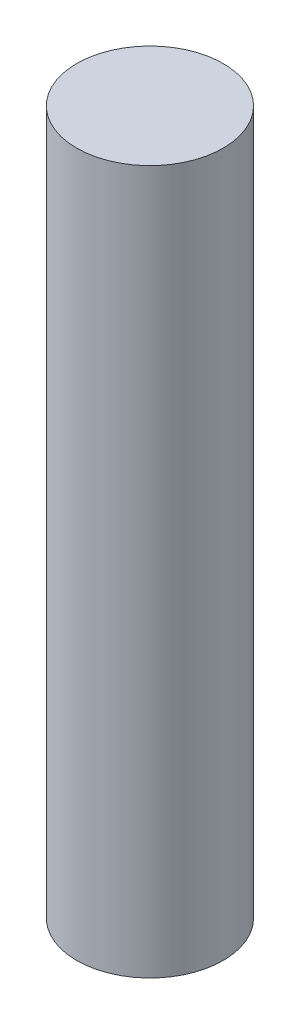
ISO-10303-21;
HEADER;
FILE_DESCRIPTION(('STEP AP214'),'2;1');
FILE_NAME('part.step','',(''),(''),'','','');
FILE_SCHEMA(('AUTOMOTIVE_DESIGN { 1 0 10303 214 1 1 1 1 }'));
ENDSEC;
DATA;
#1=APPLICATION_CONTEXT('core data for automotive mechanical design processes');
#2=APPLICATION_PROTOCOL_DEFINITION('international standard','automotive_design',2000,#1);
#3=PRODUCT_CONTEXT('',#1,'mechanical');
#4=PRODUCT('Part','Part','',(#3));
#5=PRODUCT_RELATED_PRODUCT_CATEGORY('part','',(#4));
#6=PRODUCT_DEFINITION_FORMATION('','',#4);
#7=PRODUCT_DEFINITION_CONTEXT('part definition',#1,'design');
#8=PRODUCT_DEFINITION('design','',#6,#7);
#9=PRODUCT_DEFINITION_SHAPE('','',#8);
#10=(LENGTH_UNIT() NAMED_UNIT(*) SI_UNIT(.MILLI.,.METRE.));
#11=(NAMED_UNIT(*) PLANE_ANGLE_UNIT() SI_UNIT($,.RADIAN.));
#12=(NAMED_UNIT(*) SI_UNIT($,.STERADIAN.) SOLID_ANGLE_UNIT());
#13=UNCERTAINTY_MEASURE_WITH_UNIT(LENGTH_MEASURE(1.E-05),#10,'distance_accuracy_value','');
#14=(GEOMETRIC_REPRESENTATION_CONTEXT(3) GLOBAL_UNCERTAINTY_ASSIGNED_CONTEXT((#13)) GLOBAL_UNIT_ASSIGNED_CONTEXT((#10,
#11,#12)) REPRESENTATION_CONTEXT('',''));
#15=CARTESIAN_POINT('',(0.,0.,0.));
#16=DIRECTION('',(0.,0.,1.));
#17=DIRECTION('',(1.,0.,0.));
#18=AXIS2_PLACEMENT_3D('',#15,#16,#17);
#19=CARTESIAN_POINT('',(0.,72.,0.));
#20=DIRECTION('',(0.,-1.,0.));
#21=DIRECTION('',(0.,0.,-1.));
#22=AXIS2_PLACEMENT_3D('',#19,#20,#21);
#23=CYLINDRICAL_SURFACE('',#22,7.5);
#24=CARTESIAN_POINT('',(0.,72.,0.));
#25=DIRECTION('',(0.,1.,0.));
#26=DIRECTION('',(0.,0.,1.));
#27=AXIS2_PLACEMENT_3D('',#24,#25,#26);
#28=CIRCLE('',#27,7.5);
#29=CARTESIAN_POINT('',(0.,72.,7.5));
#30=VERTEX_POINT('',#29);
#31=EDGE_CURVE('E10',#30,#30,#28,.T.);
#32=ORIENTED_EDGE('',*,*,#31,.F.);
#33=EDGE_LOOP('',(#32));
#34=FACE_BOUND('',#33,.T.);
#35=CARTESIAN_POINT('',(0.,0.,0.));
#36=DIRECTION('',(0.,1.,0.));
#37=DIRECTION('',(0.,0.,1.));
#38=AXIS2_PLACEMENT_3D('',#35,#36,#37);
#39=CIRCLE('',#38,7.5);
#40=CARTESIAN_POINT('',(0.,0.,7.5));
#41=VERTEX_POINT('',#40);
#42=EDGE_CURVE('E44',#41,#41,#39,.T.);
#43=ORIENTED_EDGE('',*,*,#42,.T.);
#44=EDGE_LOOP('',(#43));
#45=FACE_BOUND('',#44,.T.);
#46=ADVANCED_FACE('F41',(#34,#45),#23,.T.);
#47=CARTESIAN_POINT('',(0.,72.,0.));
#48=DIRECTION('',(0.,1.,0.));
#49=DIRECTION('',(0.,0.,1.));
#50=AXIS2_PLACEMENT_3D('',#47,#48,#49);
#51=PLANE('',#50);
#52=ORIENTED_EDGE('',*,*,#31,.T.);
#53=EDGE_LOOP('',(#52));
#54=FACE_BOUND('',#53,.T.);
#55=ADVANCED_FACE('F58',(#54),#51,.T.);
#56=CARTESIAN_POINT('',(0.,0.,0.));
#57=DIRECTION('',(0.,1.,0.));
#58=DIRECTION('',(0.,0.,1.));
#59=AXIS2_PLACEMENT_3D('',#56,#57,#58);
#60=PLANE('',#59);
#61=ORIENTED_EDGE('',*,*,#42,.F.);
#62=EDGE_LOOP('',(#61));
#63=FACE_BOUND('',#62,.T.);
#64=ADVANCED_FACE('F56',(#63),#60,.F.);
#65=CLOSED_SHELL('',(#46,#55,#64));
#66=MANIFOLD_SOLID_BREP('B2',#65);
#67=ADVANCED_BREP_SHAPE_REPRESENTATION('',(#18,#66),#14);
#68=SHAPE_DEFINITION_REPRESENTATION(#9,#67);
ENDSEC;
END-ISO-10303-21;
